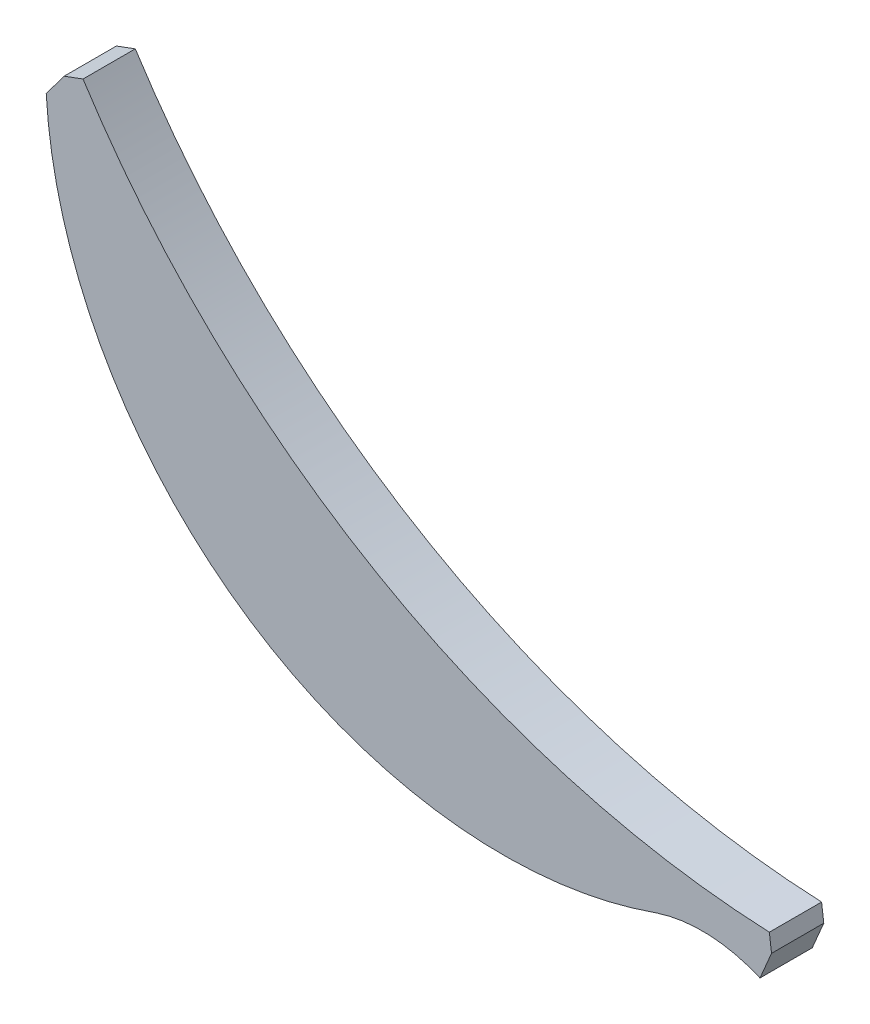
ISO-10303-21;
HEADER;
FILE_DESCRIPTION(('STEP AP214'),'2;1');
FILE_NAME('part.step','',(''),(''),'','','');
FILE_SCHEMA(('AUTOMOTIVE_DESIGN { 1 0 10303 214 1 1 1 1 }'));
ENDSEC;
DATA;
#1=APPLICATION_CONTEXT('core data for automotive mechanical design processes');
#2=APPLICATION_PROTOCOL_DEFINITION('international standard','automotive_design',2000,#1);
#3=PRODUCT_CONTEXT('',#1,'mechanical');
#4=PRODUCT('Part','Part','',(#3));
#5=PRODUCT_RELATED_PRODUCT_CATEGORY('part','',(#4));
#6=PRODUCT_DEFINITION_FORMATION('','',#4);
#7=PRODUCT_DEFINITION_CONTEXT('part definition',#1,'design');
#8=PRODUCT_DEFINITION('design','',#6,#7);
#9=PRODUCT_DEFINITION_SHAPE('','',#8);
#10=(LENGTH_UNIT() NAMED_UNIT(*) SI_UNIT(.MILLI.,.METRE.));
#11=(NAMED_UNIT(*) PLANE_ANGLE_UNIT() SI_UNIT($,.RADIAN.));
#12=(NAMED_UNIT(*) SI_UNIT($,.STERADIAN.) SOLID_ANGLE_UNIT());
#13=UNCERTAINTY_MEASURE_WITH_UNIT(LENGTH_MEASURE(1.E-05),#10,'distance_accuracy_value','');
#14=(GEOMETRIC_REPRESENTATION_CONTEXT(3) GLOBAL_UNCERTAINTY_ASSIGNED_CONTEXT((#13)) GLOBAL_UNIT_ASSIGNED_CONTEXT((#10,
#11,#12)) REPRESENTATION_CONTEXT('',''));
#15=CARTESIAN_POINT('',(0.,0.,0.));
#16=DIRECTION('',(0.,0.,1.));
#17=DIRECTION('',(1.,0.,0.));
#18=AXIS2_PLACEMENT_3D('',#15,#16,#17);
#19=CARTESIAN_POINT('',(34.8076135795317,30.7118622083128,3.));
#20=DIRECTION('',(0.,0.,-1.));
#21=DIRECTION('',(-1.,0.,0.));
#22=AXIS2_PLACEMENT_3D('',#19,#20,#21);
#23=CYLINDRICAL_SURFACE('',#22,26.2702780514934);
#24=CARTESIAN_POINT('',(34.8076135795317,30.7118622083128,0.));
#25=DIRECTION('',(0.,0.,1.));
#26=DIRECTION('',(1.,0.,0.));
#27=AXIS2_PLACEMENT_3D('',#24,#25,#26);
#28=CIRCLE('',#27,26.2702780514934);
#29=CARTESIAN_POINT('',(8.58206530790923,29.1795023434072,0.));
#30=VERTEX_POINT('',#29);
#31=CARTESIAN_POINT('',(43.6100044196305,5.96018702458197,0.));
#32=VERTEX_POINT('',#31);
#33=EDGE_CURVE('E81',#30,#32,#28,.T.);
#34=ORIENTED_EDGE('',*,*,#33,.T.);
#35=DIRECTION('',(0.,0.,-1.));
#36=VECTOR('',#35,1.);
#37=CARTESIAN_POINT('',(43.6100044196305,5.96018702458197,3.));
#38=LINE('',#37,#36);
#39=CARTESIAN_POINT('',(43.6100044196305,5.96018702458197,3.));
#40=VERTEX_POINT('',#39);
#41=EDGE_CURVE('E11',#40,#32,#38,.T.);
#42=ORIENTED_EDGE('',*,*,#41,.F.);
#43=CARTESIAN_POINT('',(34.8076135795317,30.7118622083128,3.));
#44=DIRECTION('',(0.,0.,1.));
#45=DIRECTION('',(1.,0.,0.));
#46=AXIS2_PLACEMENT_3D('',#43,#44,#45);
#47=CIRCLE('',#46,26.2702780514934);
#48=CARTESIAN_POINT('',(8.58206530790923,29.1795023434072,3.));
#49=VERTEX_POINT('',#48);
#50=EDGE_CURVE('E87',#49,#40,#47,.T.);
#51=ORIENTED_EDGE('',*,*,#50,.F.);
#52=DIRECTION('',(0.,0.,-1.));
#53=VECTOR('',#52,1.);
#54=CARTESIAN_POINT('',(8.58206530790923,29.1795023434072,3.));
#55=LINE('',#54,#53);
#56=EDGE_CURVE('E118',#49,#30,#55,.T.);
#57=ORIENTED_EDGE('',*,*,#56,.T.);
#58=EDGE_LOOP('',(#34,#42,#51,#57));
#59=FACE_BOUND('',#58,.T.);
#60=ADVANCED_FACE('F32',(#59),#23,.T.);
#61=CARTESIAN_POINT('',(46.2368964388041,-1.99402199099071,3.));
#62=DIRECTION('',(0.,0.,-1.));
#63=DIRECTION('',(-1.,0.,0.));
#64=AXIS2_PLACEMENT_3D('',#61,#62,#63);
#65=CYLINDRICAL_SURFACE('',#64,8.37675371154097);
#66=CARTESIAN_POINT('',(46.2368964388041,-1.99402199099071,0.));
#67=DIRECTION('',(0.,0.,-1.));
#68=DIRECTION('',(1.,0.,0.));
#69=AXIS2_PLACEMENT_3D('',#66,#67,#68);
#70=CIRCLE('',#69,8.37675371154097);
#71=CARTESIAN_POINT('',(49.5559812492256,5.69712088669948,0.));
#72=VERTEX_POINT('',#71);
#73=EDGE_CURVE('E123',#32,#72,#70,.T.);
#74=ORIENTED_EDGE('',*,*,#73,.T.);
#75=DIRECTION('',(0.,0.,-1.));
#76=VECTOR('',#75,1.);
#77=CARTESIAN_POINT('',(49.5559812492256,5.69712088669948,3.));
#78=LINE('',#77,#76);
#79=CARTESIAN_POINT('',(49.5559812492256,5.69712088669948,3.));
#80=VERTEX_POINT('',#79);
#81=EDGE_CURVE('E40',#80,#72,#78,.T.);
#82=ORIENTED_EDGE('',*,*,#81,.F.);
#83=CARTESIAN_POINT('',(46.2368964388041,-1.99402199099071,3.));
#84=DIRECTION('',(0.,0.,-1.));
#85=DIRECTION('',(1.,0.,0.));
#86=AXIS2_PLACEMENT_3D('',#83,#84,#85);
#87=CIRCLE('',#86,8.37675371154097);
#88=EDGE_CURVE('E153',#40,#80,#87,.T.);
#89=ORIENTED_EDGE('',*,*,#88,.F.);
#90=ORIENTED_EDGE('',*,*,#41,.T.);
#91=EDGE_LOOP('',(#74,#82,#89,#90));
#92=FACE_BOUND('',#91,.T.);
#93=ADVANCED_FACE('F157',(#92),#65,.F.);
#94=CARTESIAN_POINT('',(49.5559812492256,5.69712088669949,3.));
#95=DIRECTION('',(-0.92020785508139,0.391430074785405,0.));
#96=DIRECTION('',(-0.391430074785405,-0.92020785508139,0.));
#97=AXIS2_PLACEMENT_3D('',#94,#95,#96);
#98=PLANE('',#97);
#99=DIRECTION('',(0.391430074785405,0.92020785508139,0.));
#100=VECTOR('',#99,1.);
#101=CARTESIAN_POINT('',(49.5559812492256,5.69712088669949,0.));
#102=LINE('',#101,#100);
#103=CARTESIAN_POINT('',(50.2179346920908,7.25329859776748,0.));
#104=VERTEX_POINT('',#103);
#105=EDGE_CURVE('E125',#72,#104,#102,.T.);
#106=ORIENTED_EDGE('',*,*,#105,.T.);
#107=DIRECTION('',(0.,0.,-1.));
#108=VECTOR('',#107,1.);
#109=CARTESIAN_POINT('',(50.2179346920908,7.25329859776748,3.));
#110=LINE('',#109,#108);
#111=CARTESIAN_POINT('',(50.2179346920908,7.25329859776748,3.));
#112=VERTEX_POINT('',#111);
#113=EDGE_CURVE('E137',#112,#104,#110,.T.);
#114=ORIENTED_EDGE('',*,*,#113,.F.);
#115=DIRECTION('',(0.391430074785405,0.92020785508139,0.));
#116=VECTOR('',#115,1.);
#117=CARTESIAN_POINT('',(49.5559812492256,5.69712088669949,3.));
#118=LINE('',#117,#116);
#119=EDGE_CURVE('E146',#80,#112,#118,.T.);
#120=ORIENTED_EDGE('',*,*,#119,.F.);
#121=ORIENTED_EDGE('',*,*,#81,.T.);
#122=EDGE_LOOP('',(#106,#114,#120,#121));
#123=FACE_BOUND('',#122,.T.);
#124=ADVANCED_FACE('F144',(#123),#98,.F.);
#125=CARTESIAN_POINT('',(50.2179346920908,7.25329859776748,3.));
#126=DIRECTION('',(-0.992061103343052,-0.1257567780828,0.));
#127=DIRECTION('',(0.1257567780828,-0.992061103343052,0.));
#128=AXIS2_PLACEMENT_3D('',#125,#126,#127);
#129=PLANE('',#128);
#130=DIRECTION('',(-0.1257567780828,0.992061103343052,0.));
#131=VECTOR('',#130,1.);
#132=CARTESIAN_POINT('',(50.2179346920908,7.25329859776748,0.));
#133=LINE('',#132,#131);
#134=CARTESIAN_POINT('',(50.092452982801,8.24318975803119,0.));
#135=VERTEX_POINT('',#134);
#136=EDGE_CURVE('E127',#104,#135,#133,.T.);
#137=ORIENTED_EDGE('',*,*,#136,.T.);
#138=DIRECTION('',(0.,0.,-1.));
#139=VECTOR('',#138,1.);
#140=CARTESIAN_POINT('',(50.092452982801,8.24318975803119,3.));
#141=LINE('',#140,#139);
#142=CARTESIAN_POINT('',(50.092452982801,8.24318975803119,3.));
#143=VERTEX_POINT('',#142);
#144=EDGE_CURVE('E113',#143,#135,#141,.T.);
#145=ORIENTED_EDGE('',*,*,#144,.F.);
#146=DIRECTION('',(-0.1257567780828,0.992061103343052,0.));
#147=VECTOR('',#146,1.);
#148=CARTESIAN_POINT('',(50.2179346920908,7.25329859776748,3.));
#149=LINE('',#148,#147);
#150=EDGE_CURVE('E104',#112,#143,#149,.T.);
#151=ORIENTED_EDGE('',*,*,#150,.F.);
#152=ORIENTED_EDGE('',*,*,#113,.T.);
#153=EDGE_LOOP('',(#137,#145,#151,#152));
#154=FACE_BOUND('',#153,.T.);
#155=ADVANCED_FACE('F152',(#154),#129,.F.);
#156=CARTESIAN_POINT('',(52.2749485887935,57.5521362474995,3.));
#157=DIRECTION('',(0.,0.,-1.));
#158=DIRECTION('',(-1.,0.,0.));
#159=AXIS2_PLACEMENT_3D('',#156,#157,#158);
#160=CYLINDRICAL_SURFACE('',#159,49.3572232907346);
#161=CARTESIAN_POINT('',(52.2749485887935,57.5521362474995,0.));
#162=DIRECTION('',(0.,0.,-1.));
#163=DIRECTION('',(1.,0.,0.));
#164=AXIS2_PLACEMENT_3D('',#161,#162,#163);
#165=CIRCLE('',#164,49.3572232907346);
#166=CARTESIAN_POINT('',(10.6947907484444,30.9584158431806,0.));
#167=VERTEX_POINT('',#166);
#168=EDGE_CURVE('E112',#135,#167,#165,.T.);
#169=ORIENTED_EDGE('',*,*,#168,.T.);
#170=DIRECTION('',(0.,0.,-1.));
#171=VECTOR('',#170,1.);
#172=CARTESIAN_POINT('',(10.6947907484444,30.9584158431806,3.));
#173=LINE('',#172,#171);
#174=CARTESIAN_POINT('',(10.6947907484444,30.9584158431806,3.));
#175=VERTEX_POINT('',#174);
#176=EDGE_CURVE('E109',#175,#167,#173,.T.);
#177=ORIENTED_EDGE('',*,*,#176,.F.);
#178=CARTESIAN_POINT('',(52.2749485887935,57.5521362474995,3.));
#179=DIRECTION('',(0.,0.,-1.));
#180=DIRECTION('',(1.,0.,0.));
#181=AXIS2_PLACEMENT_3D('',#178,#179,#180);
#182=CIRCLE('',#181,49.3572232907346);
#183=EDGE_CURVE('E98',#143,#175,#182,.T.);
#184=ORIENTED_EDGE('',*,*,#183,.F.);
#185=ORIENTED_EDGE('',*,*,#144,.T.);
#186=EDGE_LOOP('',(#169,#177,#184,#185));
#187=FACE_BOUND('',#186,.T.);
#188=ADVANCED_FACE('F110',(#187),#160,.F.);
#189=CARTESIAN_POINT('',(9.61101703754377,30.5572743040698,3.));
#190=DIRECTION('',(0.347119445801309,-0.937820926588116,0.));
#191=DIRECTION('',(0.937820926588116,0.347119445801309,0.));
#192=AXIS2_PLACEMENT_3D('',#189,#190,#191);
#193=PLANE('',#192);
#194=DIRECTION('',(-0.937820926588116,-0.347119445801309,0.));
#195=VECTOR('',#194,1.);
#196=CARTESIAN_POINT('',(9.61101703754377,30.5572743040698,0.));
#197=LINE('',#196,#195);
#198=CARTESIAN_POINT('',(9.61101703754377,30.5572743040698,0.));
#199=VERTEX_POINT('',#198);
#200=EDGE_CURVE('E74',#167,#199,#197,.T.);
#201=ORIENTED_EDGE('',*,*,#200,.T.);
#202=DIRECTION('',(0.,0.,-1.));
#203=VECTOR('',#202,1.);
#204=CARTESIAN_POINT('',(9.61101703754377,30.5572743040698,3.));
#205=LINE('',#204,#203);
#206=CARTESIAN_POINT('',(9.61101703754377,30.5572743040698,3.));
#207=VERTEX_POINT('',#206);
#208=EDGE_CURVE('E114',#207,#199,#205,.T.);
#209=ORIENTED_EDGE('',*,*,#208,.F.);
#210=DIRECTION('',(-0.937820926588116,-0.347119445801309,0.));
#211=VECTOR('',#210,1.);
#212=CARTESIAN_POINT('',(9.61101703754377,30.5572743040698,3.));
#213=LINE('',#212,#211);
#214=EDGE_CURVE('E102',#175,#207,#213,.T.);
#215=ORIENTED_EDGE('',*,*,#214,.F.);
#216=ORIENTED_EDGE('',*,*,#176,.T.);
#217=EDGE_LOOP('',(#201,#209,#215,#216));
#218=FACE_BOUND('',#217,.T.);
#219=ADVANCED_FACE('F116',(#218),#193,.F.);
#220=CARTESIAN_POINT('',(8.58206530790923,29.1795023434072,3.));
#221=DIRECTION('',(0.801220186514404,-0.598369628843096,0.));
#222=DIRECTION('',(0.598369628843096,0.801220186514404,0.));
#223=AXIS2_PLACEMENT_3D('',#220,#221,#222);
#224=PLANE('',#223);
#225=DIRECTION('',(-0.598369628843096,-0.801220186514404,0.));
#226=VECTOR('',#225,1.);
#227=CARTESIAN_POINT('',(8.58206530790923,29.1795023434072,0.));
#228=LINE('',#227,#226);
#229=EDGE_CURVE('E131',#199,#30,#228,.T.);
#230=ORIENTED_EDGE('',*,*,#229,.T.);
#231=ORIENTED_EDGE('',*,*,#56,.F.);
#232=DIRECTION('',(-0.598369628843096,-0.801220186514404,0.));
#233=VECTOR('',#232,1.);
#234=CARTESIAN_POINT('',(8.58206530790923,29.1795023434072,3.));
#235=LINE('',#234,#233);
#236=EDGE_CURVE('E48',#207,#49,#235,.T.);
#237=ORIENTED_EDGE('',*,*,#236,.F.);
#238=ORIENTED_EDGE('',*,*,#208,.T.);
#239=EDGE_LOOP('',(#230,#231,#237,#238));
#240=FACE_BOUND('',#239,.T.);
#241=ADVANCED_FACE('F160',(#240),#224,.F.);
#242=CARTESIAN_POINT('',(34.8076135795317,30.7118622083128,3.));
#243=DIRECTION('',(0.,0.,1.));
#244=DIRECTION('',(1.,0.,0.));
#245=AXIS2_PLACEMENT_3D('',#242,#243,#244);
#246=PLANE('',#245);
#247=ORIENTED_EDGE('',*,*,#50,.T.);
#248=ORIENTED_EDGE('',*,*,#88,.T.);
#249=ORIENTED_EDGE('',*,*,#119,.T.);
#250=ORIENTED_EDGE('',*,*,#150,.T.);
#251=ORIENTED_EDGE('',*,*,#183,.T.);
#252=ORIENTED_EDGE('',*,*,#214,.T.);
#253=ORIENTED_EDGE('',*,*,#236,.T.);
#254=EDGE_LOOP('',(#247,#248,#249,#250,#251,#252,#253));
#255=FACE_BOUND('',#254,.T.);
#256=ADVANCED_FACE('F100',(#255),#246,.T.);
#257=CARTESIAN_POINT('',(34.8076135795317,30.7118622083128,0.));
#258=DIRECTION('',(0.,0.,1.));
#259=DIRECTION('',(1.,0.,0.));
#260=AXIS2_PLACEMENT_3D('',#257,#258,#259);
#261=PLANE('',#260);
#262=ORIENTED_EDGE('',*,*,#33,.F.);
#263=ORIENTED_EDGE('',*,*,#229,.F.);
#264=ORIENTED_EDGE('',*,*,#200,.F.);
#265=ORIENTED_EDGE('',*,*,#168,.F.);
#266=ORIENTED_EDGE('',*,*,#136,.F.);
#267=ORIENTED_EDGE('',*,*,#105,.F.);
#268=ORIENTED_EDGE('',*,*,#73,.F.);
#269=EDGE_LOOP('',(#262,#263,#264,#265,#266,#267,#268));
#270=FACE_BOUND('',#269,.T.);
#271=ADVANCED_FACE('F150',(#270),#261,.F.);
#272=CLOSED_SHELL('',(#60,#93,#124,#155,#188,#219,#241,#256,#271));
#273=MANIFOLD_SOLID_BREP('B2',#272);
#274=ADVANCED_BREP_SHAPE_REPRESENTATION('',(#18,#273),#14);
#275=SHAPE_DEFINITION_REPRESENTATION(#9,#274);
ENDSEC;
END-ISO-10303-21;
